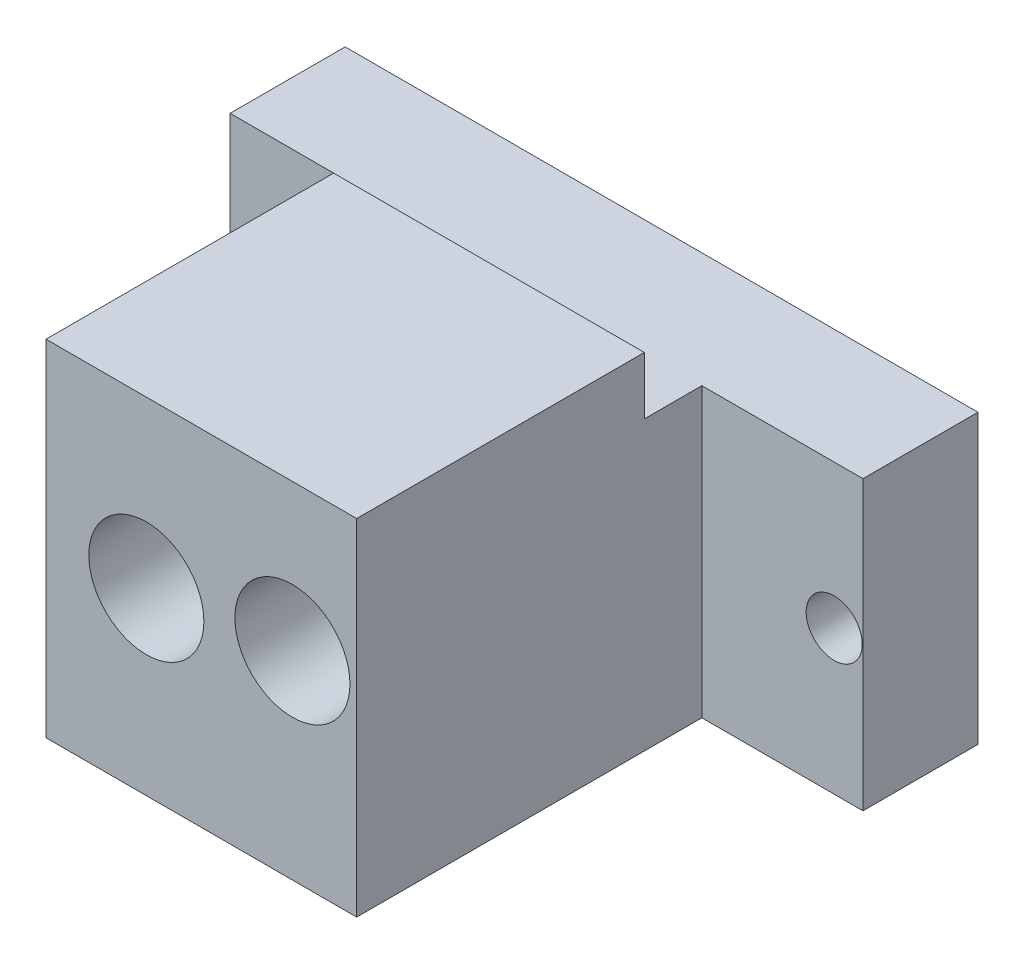
ISO-10303-21;
HEADER;
FILE_DESCRIPTION(('STEP AP214'),'2;1');
FILE_NAME('part.step','',(''),(''),'','','');
FILE_SCHEMA(('AUTOMOTIVE_DESIGN { 1 0 10303 214 1 1 1 1 }'));
ENDSEC;
DATA;
#1=APPLICATION_CONTEXT('core data for automotive mechanical design processes');
#2=APPLICATION_PROTOCOL_DEFINITION('international standard','automotive_design',2000,#1);
#3=PRODUCT_CONTEXT('',#1,'mechanical');
#4=PRODUCT('Part','Part','',(#3));
#5=PRODUCT_RELATED_PRODUCT_CATEGORY('part','',(#4));
#6=PRODUCT_DEFINITION_FORMATION('','',#4);
#7=PRODUCT_DEFINITION_CONTEXT('part definition',#1,'design');
#8=PRODUCT_DEFINITION('design','',#6,#7);
#9=PRODUCT_DEFINITION_SHAPE('','',#8);
#10=(LENGTH_UNIT() NAMED_UNIT(*) SI_UNIT(.MILLI.,.METRE.));
#11=(NAMED_UNIT(*) PLANE_ANGLE_UNIT() SI_UNIT($,.RADIAN.));
#12=(NAMED_UNIT(*) SI_UNIT($,.STERADIAN.) SOLID_ANGLE_UNIT());
#13=UNCERTAINTY_MEASURE_WITH_UNIT(LENGTH_MEASURE(1.E-05),#10,'distance_accuracy_value','');
#14=(GEOMETRIC_REPRESENTATION_CONTEXT(3) GLOBAL_UNCERTAINTY_ASSIGNED_CONTEXT((#13)) GLOBAL_UNIT_ASSIGNED_CONTEXT((#10,
#11,#12)) REPRESENTATION_CONTEXT('',''));
#15=CARTESIAN_POINT('',(0.,0.,0.));
#16=DIRECTION('',(0.,0.,1.));
#17=DIRECTION('',(1.,0.,0.));
#18=AXIS2_PLACEMENT_3D('',#15,#16,#17);
#19=CARTESIAN_POINT('',(0.,0.,10.));
#20=DIRECTION('',(0.,0.,-1.));
#21=DIRECTION('',(-1.,0.,0.));
#22=AXIS2_PLACEMENT_3D('',#19,#20,#21);
#23=PLANE('',#22);
#24=CARTESIAN_POINT('',(2.5,12.5,10.));
#25=DIRECTION('',(0.,0.,1.));
#26=DIRECTION('',(-1.,0.,0.));
#27=AXIS2_PLACEMENT_3D('',#24,#25,#26);
#28=CIRCLE('',#27,2.43506493506494);
#29=CARTESIAN_POINT('',(0.0649350649350594,12.5,10.));
#30=VERTEX_POINT('',#29);
#31=EDGE_CURVE('E168',#30,#30,#28,.T.);
#32=ORIENTED_EDGE('',*,*,#31,.F.);
#33=EDGE_LOOP('',(#32));
#34=FACE_BOUND('',#33,.T.);
#35=DIRECTION('',(0.,-1.,0.));
#36=VECTOR('',#35,1.);
#37=CARTESIAN_POINT('',(14.,25.,10.));
#38=LINE('',#37,#36);
#39=CARTESIAN_POINT('',(14.,25.,10.));
#40=VERTEX_POINT('',#39);
#41=CARTESIAN_POINT('',(14.,0.,10.));
#42=VERTEX_POINT('',#41);
#43=EDGE_CURVE('E154',#40,#42,#38,.T.);
#44=ORIENTED_EDGE('',*,*,#43,.F.);
#45=DIRECTION('',(-1.,0.,0.));
#46=VECTOR('',#45,1.);
#47=CARTESIAN_POINT('',(0.,25.,10.));
#48=LINE('',#47,#46);
#49=CARTESIAN_POINT('',(0.,25.,10.));
#50=VERTEX_POINT('',#49);
#51=EDGE_CURVE('E190',#40,#50,#48,.T.);
#52=ORIENTED_EDGE('',*,*,#51,.T.);
#53=DIRECTION('',(0.,-1.,0.));
#54=VECTOR('',#53,1.);
#55=CARTESIAN_POINT('',(0.,0.,10.));
#56=LINE('',#55,#54);
#57=CARTESIAN_POINT('',(0.,0.,10.));
#58=VERTEX_POINT('',#57);
#59=EDGE_CURVE('E180',#50,#58,#56,.T.);
#60=ORIENTED_EDGE('',*,*,#59,.T.);
#61=DIRECTION('',(1.,0.,0.));
#62=VECTOR('',#61,1.);
#63=CARTESIAN_POINT('',(0.,0.,10.));
#64=LINE('',#63,#62);
#65=EDGE_CURVE('E185',#58,#42,#64,.T.);
#66=ORIENTED_EDGE('',*,*,#65,.T.);
#67=EDGE_LOOP('',(#44,#52,#60,#66));
#68=FACE_BOUND('',#67,.T.);
#69=ADVANCED_FACE('F37',(#34,#68),#23,.F.);
#70=CARTESIAN_POINT('',(52.5,12.5,10.));
#71=DIRECTION('',(0.,0.,1.));
#72=DIRECTION('',(1.,0.,0.));
#73=AXIS2_PLACEMENT_3D('',#70,#71,#72);
#74=CIRCLE('',#73,2.43506493506494);
#75=CARTESIAN_POINT('',(54.9350649350649,12.5,10.));
#76=VERTEX_POINT('',#75);
#77=EDGE_CURVE('E174',#76,#76,#74,.T.);
#78=ORIENTED_EDGE('',*,*,#77,.F.);
#79=EDGE_LOOP('',(#78));
#80=FACE_BOUND('',#79,.T.);
#81=DIRECTION('',(0.,1.,0.));
#82=VECTOR('',#81,1.);
#83=CARTESIAN_POINT('',(41.,25.,10.));
#84=LINE('',#83,#82);
#85=CARTESIAN_POINT('',(41.,0.,10.));
#86=VERTEX_POINT('',#85);
#87=CARTESIAN_POINT('',(41.,25.,10.));
#88=VERTEX_POINT('',#87);
#89=EDGE_CURVE('E157',#86,#88,#84,.T.);
#90=ORIENTED_EDGE('',*,*,#89,.F.);
#91=CARTESIAN_POINT('',(55.,0.,10.));
#92=VERTEX_POINT('',#91);
#93=EDGE_CURVE('E183',#86,#92,#64,.T.);
#94=ORIENTED_EDGE('',*,*,#93,.T.);
#95=DIRECTION('',(0.,1.,0.));
#96=VECTOR('',#95,1.);
#97=CARTESIAN_POINT('',(55.,0.,10.));
#98=LINE('',#97,#96);
#99=CARTESIAN_POINT('',(55.,25.,10.));
#100=VERTEX_POINT('',#99);
#101=EDGE_CURVE('E188',#92,#100,#98,.T.);
#102=ORIENTED_EDGE('',*,*,#101,.T.);
#103=EDGE_CURVE('E191',#100,#88,#48,.T.);
#104=ORIENTED_EDGE('',*,*,#103,.T.);
#105=EDGE_LOOP('',(#90,#94,#102,#104));
#106=FACE_BOUND('',#105,.T.);
#107=ADVANCED_FACE('F231',(#80,#106),#23,.F.);
#108=CARTESIAN_POINT('',(0.,0.,0.));
#109=DIRECTION('',(0.,0.,-1.));
#110=DIRECTION('',(-1.,0.,0.));
#111=AXIS2_PLACEMENT_3D('',#108,#109,#110);
#112=PLANE('',#111);
#113=CARTESIAN_POINT('',(52.5,12.5,0.));
#114=DIRECTION('',(0.,0.,1.));
#115=DIRECTION('',(1.,0.,0.));
#116=AXIS2_PLACEMENT_3D('',#113,#114,#115);
#117=CIRCLE('',#116,2.43506493506494);
#118=CARTESIAN_POINT('',(54.9350649350649,12.5,0.));
#119=VERTEX_POINT('',#118);
#120=EDGE_CURVE('E171',#119,#119,#117,.T.);
#121=ORIENTED_EDGE('',*,*,#120,.T.);
#122=EDGE_LOOP('',(#121));
#123=FACE_BOUND('',#122,.T.);
#124=DIRECTION('',(0.,-1.,0.));
#125=VECTOR('',#124,1.);
#126=CARTESIAN_POINT('',(0.,0.,0.));
#127=LINE('',#126,#125);
#128=CARTESIAN_POINT('',(0.,25.,0.));
#129=VERTEX_POINT('',#128);
#130=CARTESIAN_POINT('',(0.,0.,0.));
#131=VERTEX_POINT('',#130);
#132=EDGE_CURVE('E177',#129,#131,#127,.T.);
#133=ORIENTED_EDGE('',*,*,#132,.F.);
#134=DIRECTION('',(-1.,0.,0.));
#135=VECTOR('',#134,1.);
#136=CARTESIAN_POINT('',(0.,25.,0.));
#137=LINE('',#136,#135);
#138=CARTESIAN_POINT('',(55.,25.,0.));
#139=VERTEX_POINT('',#138);
#140=EDGE_CURVE('E184',#139,#129,#137,.T.);
#141=ORIENTED_EDGE('',*,*,#140,.F.);
#142=DIRECTION('',(0.,1.,0.));
#143=VECTOR('',#142,1.);
#144=CARTESIAN_POINT('',(55.,0.,0.));
#145=LINE('',#144,#143);
#146=CARTESIAN_POINT('',(55.,0.,0.));
#147=VERTEX_POINT('',#146);
#148=EDGE_CURVE('E199',#147,#139,#145,.T.);
#149=ORIENTED_EDGE('',*,*,#148,.F.);
#150=DIRECTION('',(1.,0.,0.));
#151=VECTOR('',#150,1.);
#152=CARTESIAN_POINT('',(0.,0.,0.));
#153=LINE('',#152,#151);
#154=EDGE_CURVE('E197',#131,#147,#153,.T.);
#155=ORIENTED_EDGE('',*,*,#154,.F.);
#156=EDGE_LOOP('',(#133,#141,#149,#155));
#157=FACE_BOUND('',#156,.T.);
#158=CARTESIAN_POINT('',(2.5,12.5,0.));
#159=DIRECTION('',(0.,0.,1.));
#160=DIRECTION('',(-1.,0.,0.));
#161=AXIS2_PLACEMENT_3D('',#158,#159,#160);
#162=CIRCLE('',#161,2.43506493506494);
#163=CARTESIAN_POINT('',(0.0649350649350594,12.5,0.));
#164=VERTEX_POINT('',#163);
#165=EDGE_CURVE('E167',#164,#164,#162,.T.);
#166=ORIENTED_EDGE('',*,*,#165,.T.);
#167=EDGE_LOOP('',(#166));
#168=FACE_BOUND('',#167,.T.);
#169=ADVANCED_FACE('F218',(#123,#157,#168),#112,.T.);
#170=CARTESIAN_POINT('',(0.,0.,10.));
#171=DIRECTION('',(1.,0.,0.));
#172=DIRECTION('',(0.,0.,-1.));
#173=AXIS2_PLACEMENT_3D('',#170,#171,#172);
#174=PLANE('',#173);
#175=ORIENTED_EDGE('',*,*,#132,.T.);
#176=DIRECTION('',(0.,0.,-1.));
#177=VECTOR('',#176,1.);
#178=CARTESIAN_POINT('',(0.,0.,10.));
#179=LINE('',#178,#177);
#180=EDGE_CURVE('E11',#58,#131,#179,.T.);
#181=ORIENTED_EDGE('',*,*,#180,.F.);
#182=ORIENTED_EDGE('',*,*,#59,.F.);
#183=DIRECTION('',(0.,0.,-1.));
#184=VECTOR('',#183,1.);
#185=CARTESIAN_POINT('',(0.,25.,10.));
#186=LINE('',#185,#184);
#187=EDGE_CURVE('E194',#50,#129,#186,.T.);
#188=ORIENTED_EDGE('',*,*,#187,.T.);
#189=EDGE_LOOP('',(#175,#181,#182,#188));
#190=FACE_BOUND('',#189,.T.);
#191=ADVANCED_FACE('F39',(#190),#174,.F.);
#192=CARTESIAN_POINT('',(0.,0.,10.));
#193=DIRECTION('',(0.,1.,0.));
#194=DIRECTION('',(0.,0.,1.));
#195=AXIS2_PLACEMENT_3D('',#192,#193,#194);
#196=PLANE('',#195);
#197=ORIENTED_EDGE('',*,*,#93,.F.);
#198=DIRECTION('',(0.,0.,-1.));
#199=VECTOR('',#198,1.);
#200=CARTESIAN_POINT('',(41.,0.,40.));
#201=LINE('',#200,#199);
#202=CARTESIAN_POINT('',(41.,0.,40.));
#203=VERTEX_POINT('',#202);
#204=EDGE_CURVE('E60',#203,#86,#201,.T.);
#205=ORIENTED_EDGE('',*,*,#204,.F.);
#206=DIRECTION('',(1.,0.,0.));
#207=VECTOR('',#206,1.);
#208=CARTESIAN_POINT('',(14.,0.,40.));
#209=LINE('',#208,#207);
#210=CARTESIAN_POINT('',(14.,0.,40.));
#211=VERTEX_POINT('',#210);
#212=EDGE_CURVE('E122',#211,#203,#209,.T.);
#213=ORIENTED_EDGE('',*,*,#212,.F.);
#214=DIRECTION('',(0.,0.,-1.));
#215=VECTOR('',#214,1.);
#216=CARTESIAN_POINT('',(14.,0.,40.));
#217=LINE('',#216,#215);
#218=EDGE_CURVE('E165',#211,#42,#217,.T.);
#219=ORIENTED_EDGE('',*,*,#218,.T.);
#220=ORIENTED_EDGE('',*,*,#65,.F.);
#221=ORIENTED_EDGE('',*,*,#180,.T.);
#222=ORIENTED_EDGE('',*,*,#154,.T.);
#223=DIRECTION('',(0.,0.,-1.));
#224=VECTOR('',#223,1.);
#225=CARTESIAN_POINT('',(55.,0.,10.));
#226=LINE('',#225,#224);
#227=EDGE_CURVE('E45',#92,#147,#226,.T.);
#228=ORIENTED_EDGE('',*,*,#227,.F.);
#229=EDGE_LOOP('',(#197,#205,#213,#219,#220,#221,#222,#228));
#230=FACE_BOUND('',#229,.T.);
#231=ADVANCED_FACE('F232',(#230),#196,.F.);
#232=CARTESIAN_POINT('',(55.,0.,10.));
#233=DIRECTION('',(-1.,0.,0.));
#234=DIRECTION('',(0.,0.,1.));
#235=AXIS2_PLACEMENT_3D('',#232,#233,#234);
#236=PLANE('',#235);
#237=ORIENTED_EDGE('',*,*,#148,.T.);
#238=DIRECTION('',(0.,0.,-1.));
#239=VECTOR('',#238,1.);
#240=CARTESIAN_POINT('',(55.,25.,10.));
#241=LINE('',#240,#239);
#242=EDGE_CURVE('E204',#100,#139,#241,.T.);
#243=ORIENTED_EDGE('',*,*,#242,.F.);
#244=ORIENTED_EDGE('',*,*,#101,.F.);
#245=ORIENTED_EDGE('',*,*,#227,.T.);
#246=EDGE_LOOP('',(#237,#243,#244,#245));
#247=FACE_BOUND('',#246,.T.);
#248=ADVANCED_FACE('F211',(#247),#236,.F.);
#249=CARTESIAN_POINT('',(0.,25.,10.));
#250=DIRECTION('',(0.,-1.,0.));
#251=DIRECTION('',(0.,0.,-1.));
#252=AXIS2_PLACEMENT_3D('',#249,#250,#251);
#253=PLANE('',#252);
#254=DIRECTION('',(0.,0.,-1.));
#255=VECTOR('',#254,1.);
#256=CARTESIAN_POINT('',(14.,25.,40.));
#257=LINE('',#256,#255);
#258=CARTESIAN_POINT('',(14.,25.,15.));
#259=VERTEX_POINT('',#258);
#260=EDGE_CURVE('E52',#259,#40,#257,.T.);
#261=ORIENTED_EDGE('',*,*,#260,.F.);
#262=DIRECTION('',(1.,0.,0.));
#263=VECTOR('',#262,1.);
#264=CARTESIAN_POINT('',(0.,25.,15.));
#265=LINE('',#264,#263);
#266=CARTESIAN_POINT('',(41.,25.,15.));
#267=VERTEX_POINT('',#266);
#268=EDGE_CURVE('E150',#259,#267,#265,.T.);
#269=ORIENTED_EDGE('',*,*,#268,.T.);
#270=DIRECTION('',(0.,0.,-1.));
#271=VECTOR('',#270,1.);
#272=CARTESIAN_POINT('',(41.,25.,40.));
#273=LINE('',#272,#271);
#274=EDGE_CURVE('E162',#267,#88,#273,.T.);
#275=ORIENTED_EDGE('',*,*,#274,.T.);
#276=ORIENTED_EDGE('',*,*,#103,.F.);
#277=ORIENTED_EDGE('',*,*,#242,.T.);
#278=ORIENTED_EDGE('',*,*,#140,.T.);
#279=ORIENTED_EDGE('',*,*,#187,.F.);
#280=ORIENTED_EDGE('',*,*,#51,.F.);
#281=EDGE_LOOP('',(#261,#269,#275,#276,#277,#278,#279,#280));
#282=FACE_BOUND('',#281,.T.);
#283=ADVANCED_FACE('F222',(#282),#253,.F.);
#284=CARTESIAN_POINT('',(52.5,12.5,10.));
#285=DIRECTION('',(0.,0.,-1.));
#286=DIRECTION('',(-1.,0.,0.));
#287=AXIS2_PLACEMENT_3D('',#284,#285,#286);
#288=CYLINDRICAL_SURFACE('',#287,2.43506493506494);
#289=ORIENTED_EDGE('',*,*,#77,.T.);
#290=EDGE_LOOP('',(#289));
#291=FACE_BOUND('',#290,.T.);
#292=ORIENTED_EDGE('',*,*,#120,.F.);
#293=EDGE_LOOP('',(#292));
#294=FACE_BOUND('',#293,.T.);
#295=ADVANCED_FACE('F243',(#291,#294),#288,.F.);
#296=CARTESIAN_POINT('',(2.5,12.5,10.));
#297=DIRECTION('',(0.,0.,-1.));
#298=DIRECTION('',(-1.,0.,0.));
#299=AXIS2_PLACEMENT_3D('',#296,#297,#298);
#300=CYLINDRICAL_SURFACE('',#299,2.43506493506494);
#301=ORIENTED_EDGE('',*,*,#31,.T.);
#302=EDGE_LOOP('',(#301));
#303=FACE_BOUND('',#302,.T.);
#304=ORIENTED_EDGE('',*,*,#165,.F.);
#305=EDGE_LOOP('',(#304));
#306=FACE_BOUND('',#305,.T.);
#307=ADVANCED_FACE('F236',(#303,#306),#300,.F.);
#308=CARTESIAN_POINT('',(14.,25.,40.));
#309=DIRECTION('',(1.,0.,0.));
#310=DIRECTION('',(0.,1.,0.));
#311=AXIS2_PLACEMENT_3D('',#308,#309,#310);
#312=PLANE('',#311);
#313=ORIENTED_EDGE('',*,*,#43,.T.);
#314=ORIENTED_EDGE('',*,*,#218,.F.);
#315=DIRECTION('',(0.,-1.,0.));
#316=VECTOR('',#315,1.);
#317=CARTESIAN_POINT('',(14.,25.,40.));
#318=LINE('',#317,#316);
#319=CARTESIAN_POINT('',(14.,30.,40.));
#320=VERTEX_POINT('',#319);
#321=EDGE_CURVE('E155',#320,#211,#318,.T.);
#322=ORIENTED_EDGE('',*,*,#321,.F.);
#323=DIRECTION('',(0.,0.,-1.));
#324=VECTOR('',#323,1.);
#325=CARTESIAN_POINT('',(14.,30.,40.));
#326=LINE('',#325,#324);
#327=CARTESIAN_POINT('',(14.,30.,15.));
#328=VERTEX_POINT('',#327);
#329=EDGE_CURVE('E133',#320,#328,#326,.T.);
#330=ORIENTED_EDGE('',*,*,#329,.T.);
#331=DIRECTION('',(0.,-1.,0.));
#332=VECTOR('',#331,1.);
#333=CARTESIAN_POINT('',(14.,30.,15.));
#334=LINE('',#333,#332);
#335=EDGE_CURVE('E148',#328,#259,#334,.T.);
#336=ORIENTED_EDGE('',*,*,#335,.T.);
#337=ORIENTED_EDGE('',*,*,#260,.T.);
#338=EDGE_LOOP('',(#313,#314,#322,#330,#336,#337));
#339=FACE_BOUND('',#338,.T.);
#340=ADVANCED_FACE('F234',(#339),#312,.F.);
#341=CARTESIAN_POINT('',(41.,25.,40.));
#342=DIRECTION('',(-1.,0.,0.));
#343=DIRECTION('',(0.,0.,1.));
#344=AXIS2_PLACEMENT_3D('',#341,#342,#343);
#345=PLANE('',#344);
#346=ORIENTED_EDGE('',*,*,#274,.F.);
#347=DIRECTION('',(0.,-1.,0.));
#348=VECTOR('',#347,1.);
#349=CARTESIAN_POINT('',(41.,30.,15.));
#350=LINE('',#349,#348);
#351=CARTESIAN_POINT('',(41.,30.,15.));
#352=VERTEX_POINT('',#351);
#353=EDGE_CURVE('E137',#352,#267,#350,.T.);
#354=ORIENTED_EDGE('',*,*,#353,.F.);
#355=DIRECTION('',(0.,0.,1.));
#356=VECTOR('',#355,1.);
#357=CARTESIAN_POINT('',(41.,30.,40.));
#358=LINE('',#357,#356);
#359=CARTESIAN_POINT('',(41.,30.,40.));
#360=VERTEX_POINT('',#359);
#361=EDGE_CURVE('E130',#352,#360,#358,.T.);
#362=ORIENTED_EDGE('',*,*,#361,.T.);
#363=DIRECTION('',(0.,1.,0.));
#364=VECTOR('',#363,1.);
#365=CARTESIAN_POINT('',(41.,25.,40.));
#366=LINE('',#365,#364);
#367=EDGE_CURVE('E117',#203,#360,#366,.T.);
#368=ORIENTED_EDGE('',*,*,#367,.F.);
#369=ORIENTED_EDGE('',*,*,#204,.T.);
#370=ORIENTED_EDGE('',*,*,#89,.T.);
#371=EDGE_LOOP('',(#346,#354,#362,#368,#369,#370));
#372=FACE_BOUND('',#371,.T.);
#373=ADVANCED_FACE('F136',(#372),#345,.F.);
#374=CARTESIAN_POINT('',(0.,0.,40.));
#375=DIRECTION('',(0.,0.,1.));
#376=DIRECTION('',(1.,0.,0.));
#377=AXIS2_PLACEMENT_3D('',#374,#375,#376);
#378=PLANE('',#377);
#379=CARTESIAN_POINT('',(35.4161529499208,17.2480101583687,40.));
#380=DIRECTION('',(0.,0.,1.));
#381=DIRECTION('',(1.,0.,0.));
#382=AXIS2_PLACEMENT_3D('',#379,#380,#381);
#383=CIRCLE('',#382,5.);
#384=CARTESIAN_POINT('',(40.4161529499208,17.2480101583687,40.));
#385=VERTEX_POINT('',#384);
#386=EDGE_CURVE('E378',#385,#385,#383,.T.);
#387=ORIENTED_EDGE('',*,*,#386,.F.);
#388=EDGE_LOOP('',(#387));
#389=FACE_BOUND('',#388,.T.);
#390=CARTESIAN_POINT('',(22.7215484995611,15.6125042185522,40.));
#391=DIRECTION('',(0.,0.,1.));
#392=DIRECTION('',(1.,0.,0.));
#393=AXIS2_PLACEMENT_3D('',#390,#391,#392);
#394=CIRCLE('',#393,5.);
#395=CARTESIAN_POINT('',(27.7215484995611,15.6125042185522,40.));
#396=VERTEX_POINT('',#395);
#397=EDGE_CURVE('E141',#396,#396,#394,.T.);
#398=ORIENTED_EDGE('',*,*,#397,.F.);
#399=EDGE_LOOP('',(#398));
#400=FACE_BOUND('',#399,.T.);
#401=ORIENTED_EDGE('',*,*,#321,.T.);
#402=ORIENTED_EDGE('',*,*,#212,.T.);
#403=ORIENTED_EDGE('',*,*,#367,.T.);
#404=DIRECTION('',(-1.,0.,0.));
#405=VECTOR('',#404,1.);
#406=CARTESIAN_POINT('',(41.,30.,40.));
#407=LINE('',#406,#405);
#408=EDGE_CURVE('E121',#360,#320,#407,.T.);
#409=ORIENTED_EDGE('',*,*,#408,.T.);
#410=EDGE_LOOP('',(#401,#402,#403,#409));
#411=FACE_BOUND('',#410,.T.);
#412=ADVANCED_FACE('F120',(#389,#400,#411),#378,.T.);
#413=CARTESIAN_POINT('',(41.,30.,15.));
#414=DIRECTION('',(0.,0.,-1.));
#415=DIRECTION('',(-1.,0.,0.));
#416=AXIS2_PLACEMENT_3D('',#413,#414,#415);
#417=PLANE('',#416);
#418=ORIENTED_EDGE('',*,*,#268,.F.);
#419=ORIENTED_EDGE('',*,*,#335,.F.);
#420=DIRECTION('',(1.,0.,0.));
#421=VECTOR('',#420,1.);
#422=CARTESIAN_POINT('',(41.,30.,15.));
#423=LINE('',#422,#421);
#424=EDGE_CURVE('E146',#328,#352,#423,.T.);
#425=ORIENTED_EDGE('',*,*,#424,.T.);
#426=ORIENTED_EDGE('',*,*,#353,.T.);
#427=EDGE_LOOP('',(#418,#419,#425,#426));
#428=FACE_BOUND('',#427,.T.);
#429=ADVANCED_FACE('F314',(#428),#417,.T.);
#430=CARTESIAN_POINT('',(0.,30.,0.));
#431=DIRECTION('',(0.,1.,0.));
#432=DIRECTION('',(0.,0.,1.));
#433=AXIS2_PLACEMENT_3D('',#430,#431,#432);
#434=PLANE('',#433);
#435=ORIENTED_EDGE('',*,*,#361,.F.);
#436=ORIENTED_EDGE('',*,*,#424,.F.);
#437=ORIENTED_EDGE('',*,*,#329,.F.);
#438=ORIENTED_EDGE('',*,*,#408,.F.);
#439=EDGE_LOOP('',(#435,#436,#437,#438));
#440=FACE_BOUND('',#439,.T.);
#441=ADVANCED_FACE('F128',(#440),#434,.T.);
#442=CARTESIAN_POINT('',(22.7215484995611,15.6125042185522,20.));
#443=DIRECTION('',(0.,0.,1.));
#444=DIRECTION('',(1.,0.,0.));
#445=AXIS2_PLACEMENT_3D('',#442,#443,#444);
#446=CYLINDRICAL_SURFACE('',#445,5.);
#447=CARTESIAN_POINT('',(22.7215484995611,15.6125042185522,20.));
#448=DIRECTION('',(0.,0.,1.));
#449=DIRECTION('',(1.,0.,0.));
#450=AXIS2_PLACEMENT_3D('',#447,#448,#449);
#451=CIRCLE('',#450,5.);
#452=CARTESIAN_POINT('',(27.7215484995611,15.6125042185522,20.));
#453=VERTEX_POINT('',#452);
#454=EDGE_CURVE('E138',#453,#453,#451,.T.);
#455=ORIENTED_EDGE('',*,*,#454,.F.);
#456=EDGE_LOOP('',(#455));
#457=FACE_BOUND('',#456,.T.);
#458=ORIENTED_EDGE('',*,*,#397,.T.);
#459=EDGE_LOOP('',(#458));
#460=FACE_BOUND('',#459,.T.);
#461=ADVANCED_FACE('F327',(#457,#460),#446,.F.);
#462=CARTESIAN_POINT('',(22.7215484995611,15.6125042185522,20.));
#463=DIRECTION('',(0.,0.,1.));
#464=DIRECTION('',(1.,0.,0.));
#465=AXIS2_PLACEMENT_3D('',#462,#463,#464);
#466=PLANE('',#465);
#467=ORIENTED_EDGE('',*,*,#454,.T.);
#468=EDGE_LOOP('',(#467));
#469=FACE_BOUND('',#468,.T.);
#470=ADVANCED_FACE('F341',(#469),#466,.T.);
#471=CARTESIAN_POINT('',(35.4161529499208,17.2480101583687,20.));
#472=DIRECTION('',(0.,0.,1.));
#473=DIRECTION('',(1.,0.,0.));
#474=AXIS2_PLACEMENT_3D('',#471,#472,#473);
#475=CYLINDRICAL_SURFACE('',#474,5.);
#476=CARTESIAN_POINT('',(35.4161529499208,17.2480101583687,20.));
#477=DIRECTION('',(0.,0.,1.));
#478=DIRECTION('',(1.,0.,0.));
#479=AXIS2_PLACEMENT_3D('',#476,#477,#478);
#480=CIRCLE('',#479,5.);
#481=CARTESIAN_POINT('',(40.4161529499208,17.2480101583687,20.));
#482=VERTEX_POINT('',#481);
#483=EDGE_CURVE('E377',#482,#482,#480,.T.);
#484=ORIENTED_EDGE('',*,*,#483,.F.);
#485=EDGE_LOOP('',(#484));
#486=FACE_BOUND('',#485,.T.);
#487=ORIENTED_EDGE('',*,*,#386,.T.);
#488=EDGE_LOOP('',(#487));
#489=FACE_BOUND('',#488,.T.);
#490=ADVANCED_FACE('F351',(#486,#489),#475,.F.);
#491=CARTESIAN_POINT('',(35.4161529499208,17.2480101583687,20.));
#492=DIRECTION('',(0.,0.,1.));
#493=DIRECTION('',(1.,0.,0.));
#494=AXIS2_PLACEMENT_3D('',#491,#492,#493);
#495=PLANE('',#494);
#496=ORIENTED_EDGE('',*,*,#483,.T.);
#497=EDGE_LOOP('',(#496));
#498=FACE_BOUND('',#497,.T.);
#499=ADVANCED_FACE('F361',(#498),#495,.T.);
#500=CLOSED_SHELL('',(#69,#107,#169,#191,#231,#248,#283,#295,#307,#340,#373,#412,#429,#441,#461,
#470,#490,#499));
#501=MANIFOLD_SOLID_BREP('B2',#500);
#502=ADVANCED_BREP_SHAPE_REPRESENTATION('',(#18,#501),#14);
#503=SHAPE_DEFINITION_REPRESENTATION(#9,#502);
ENDSEC;
END-ISO-10303-21;
